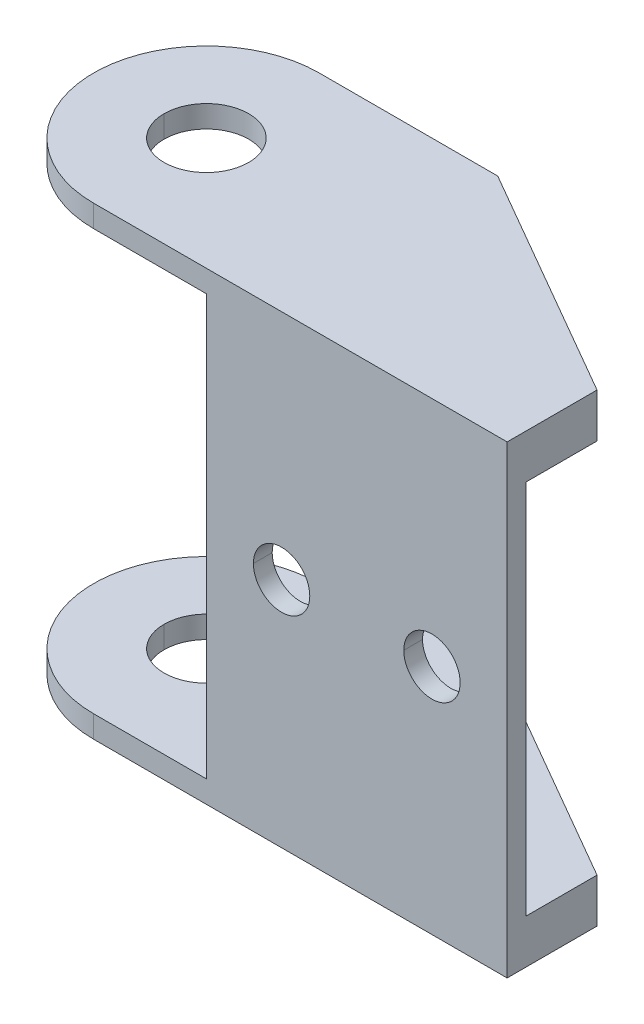
ISO-10303-21;
HEADER;
FILE_DESCRIPTION(('STEP AP214'),'2;1');
FILE_NAME('part.step','',(''),(''),'','','');
FILE_SCHEMA(('AUTOMOTIVE_DESIGN { 1 0 10303 214 1 1 1 1 }'));
ENDSEC;
DATA;
#1=APPLICATION_CONTEXT('core data for automotive mechanical design processes');
#2=APPLICATION_PROTOCOL_DEFINITION('international standard','automotive_design',2000,#1);
#3=PRODUCT_CONTEXT('',#1,'mechanical');
#4=PRODUCT('Part','Part','',(#3));
#5=PRODUCT_RELATED_PRODUCT_CATEGORY('part','',(#4));
#6=PRODUCT_DEFINITION_FORMATION('','',#4);
#7=PRODUCT_DEFINITION_CONTEXT('part definition',#1,'design');
#8=PRODUCT_DEFINITION('design','',#6,#7);
#9=PRODUCT_DEFINITION_SHAPE('','',#8);
#10=(LENGTH_UNIT() NAMED_UNIT(*) SI_UNIT(.MILLI.,.METRE.));
#11=(NAMED_UNIT(*) PLANE_ANGLE_UNIT() SI_UNIT($,.RADIAN.));
#12=(NAMED_UNIT(*) SI_UNIT($,.STERADIAN.) SOLID_ANGLE_UNIT());
#13=UNCERTAINTY_MEASURE_WITH_UNIT(LENGTH_MEASURE(1.E-05),#10,'distance_accuracy_value','');
#14=(GEOMETRIC_REPRESENTATION_CONTEXT(3) GLOBAL_UNCERTAINTY_ASSIGNED_CONTEXT((#13)) GLOBAL_UNIT_ASSIGNED_CONTEXT((#10,
#11,#12)) REPRESENTATION_CONTEXT('',''));
#15=CARTESIAN_POINT('',(0.,0.,0.));
#16=DIRECTION('',(0.,0.,1.));
#17=DIRECTION('',(1.,0.,0.));
#18=AXIS2_PLACEMENT_3D('',#15,#16,#17);
#19=CARTESIAN_POINT('',(0.,-1.175,76.));
#20=DIRECTION('',(0.,1.,0.));
#21=DIRECTION('',(1.,0.,0.));
#22=AXIS2_PLACEMENT_3D('',#19,#20,#21);
#23=PLANE('',#22);
#24=CARTESIAN_POINT('',(0.,-1.175,76.));
#25=DIRECTION('',(0.,-1.,0.));
#26=DIRECTION('',(1.,0.,0.));
#27=AXIS2_PLACEMENT_3D('',#24,#25,#26);
#28=CIRCLE('',#27,2.25);
#29=CARTESIAN_POINT('',(-2.25,-1.175,76.));
#30=VERTEX_POINT('',#29);
#31=CARTESIAN_POINT('',(2.25,-1.175,76.));
#32=VERTEX_POINT('',#31);
#33=EDGE_CURVE('E257',#30,#32,#28,.T.);
#34=ORIENTED_EDGE('',*,*,#33,.T.);
#35=CARTESIAN_POINT('',(0.,-1.175,76.));
#36=DIRECTION('',(0.,-1.,0.));
#37=DIRECTION('',(1.,0.,0.));
#38=AXIS2_PLACEMENT_3D('',#35,#36,#37);
#39=CIRCLE('',#38,2.25);
#40=EDGE_CURVE('E411',#32,#30,#39,.T.);
#41=ORIENTED_EDGE('',*,*,#40,.T.);
#42=EDGE_LOOP('',(#34,#41));
#43=FACE_BOUND('',#42,.T.);
#44=CARTESIAN_POINT('',(0.,-1.175,76.));
#45=DIRECTION('',(0.,-1.,0.));
#46=DIRECTION('',(0.,0.,-1.));
#47=AXIS2_PLACEMENT_3D('',#44,#45,#46);
#48=CIRCLE('',#47,6.);
#49=CARTESIAN_POINT('',(0.,-1.175,82.));
#50=VERTEX_POINT('',#49);
#51=CARTESIAN_POINT('',(0.,-1.175,70.));
#52=VERTEX_POINT('',#51);
#53=EDGE_CURVE('E293',#50,#52,#48,.T.);
#54=ORIENTED_EDGE('',*,*,#53,.F.);
#55=DIRECTION('',(-1.,0.,0.));
#56=VECTOR('',#55,1.);
#57=CARTESIAN_POINT('',(5.5,-1.175,82.));
#58=LINE('',#57,#56);
#59=CARTESIAN_POINT('',(6.,-1.175,82.));
#60=VERTEX_POINT('',#59);
#61=EDGE_CURVE('E162',#60,#50,#58,.T.);
#62=ORIENTED_EDGE('',*,*,#61,.F.);
#63=DIRECTION('',(0.,0.,1.));
#64=VECTOR('',#63,1.);
#65=CARTESIAN_POINT('',(6.,-1.175,76.));
#66=LINE('',#65,#64);
#67=CARTESIAN_POINT('',(6.,-1.175,70.));
#68=VERTEX_POINT('',#67);
#69=EDGE_CURVE('E283',#68,#60,#66,.T.);
#70=ORIENTED_EDGE('',*,*,#69,.F.);
#71=DIRECTION('',(1.,0.,0.));
#72=VECTOR('',#71,1.);
#73=CARTESIAN_POINT('',(2.375,-1.175,70.));
#74=LINE('',#73,#72);
#75=EDGE_CURVE('E173',#52,#68,#74,.T.);
#76=ORIENTED_EDGE('',*,*,#75,.F.);
#77=EDGE_LOOP('',(#54,#62,#70,#76));
#78=FACE_BOUND('',#77,.T.);
#79=ADVANCED_FACE('F16',(#43,#78),#23,.T.);
#80=CARTESIAN_POINT('',(11.,0.,76.));
#81=DIRECTION('',(0.,1.,0.));
#82=DIRECTION('',(1.,0.,0.));
#83=AXIS2_PLACEMENT_3D('',#80,#81,#82);
#84=PLANE('',#83);
#85=DIRECTION('',(1.,0.,0.));
#86=VECTOR('',#85,1.);
#87=CARTESIAN_POINT('',(12.5,0.,81.));
#88=LINE('',#87,#86);
#89=CARTESIAN_POINT('',(6.,0.,81.));
#90=VERTEX_POINT('',#89);
#91=CARTESIAN_POINT('',(22.,0.,81.));
#92=VERTEX_POINT('',#91);
#93=EDGE_CURVE('E351',#90,#92,#88,.T.);
#94=ORIENTED_EDGE('',*,*,#93,.T.);
#95=DIRECTION('',(0.,0.,1.));
#96=VECTOR('',#95,1.);
#97=CARTESIAN_POINT('',(22.,0.,77.804219591225));
#98=LINE('',#97,#96);
#99=CARTESIAN_POINT('',(22.,0.,77.2168783649));
#100=VERTEX_POINT('',#99);
#101=EDGE_CURVE('E308',#100,#92,#98,.T.);
#102=ORIENTED_EDGE('',*,*,#101,.F.);
#103=DIRECTION('',(0.866025403783548,0.,0.500000000001542));
#104=VECTOR('',#103,1.);
#105=CARTESIAN_POINT('',(14.4865381056782,0.,72.8789791176495));
#106=LINE('',#105,#104);
#107=CARTESIAN_POINT('',(9.5,0.,70.));
#108=VERTEX_POINT('',#107);
#109=EDGE_CURVE('E11',#108,#100,#106,.T.);
#110=ORIENTED_EDGE('',*,*,#109,.F.);
#111=DIRECTION('',(1.,0.,0.));
#112=VECTOR('',#111,1.);
#113=CARTESIAN_POINT('',(7.875,0.,70.));
#114=LINE('',#113,#112);
#115=CARTESIAN_POINT('',(6.,0.,70.));
#116=VERTEX_POINT('',#115);
#117=EDGE_CURVE('E324',#116,#108,#114,.T.);
#118=ORIENTED_EDGE('',*,*,#117,.F.);
#119=DIRECTION('',(0.,0.,-1.));
#120=VECTOR('',#119,1.);
#121=CARTESIAN_POINT('',(6.,0.,76.));
#122=LINE('',#121,#120);
#123=EDGE_CURVE('E285',#90,#116,#122,.T.);
#124=ORIENTED_EDGE('',*,*,#123,.F.);
#125=EDGE_LOOP('',(#94,#102,#110,#118,#124));
#126=FACE_BOUND('',#125,.T.);
#127=ADVANCED_FACE('F449',(#126),#84,.T.);
#128=CARTESIAN_POINT('',(15.75,22.35,73.60843918245));
#129=DIRECTION('',(0.500000000001542,0.,-0.866025403783548));
#130=DIRECTION('',(0.,-1.,0.));
#131=AXIS2_PLACEMENT_3D('',#128,#129,#130);
#132=PLANE('',#131);
#133=ORIENTED_EDGE('',*,*,#109,.T.);
#134=DIRECTION('',(0.,-1.,0.));
#135=VECTOR('',#134,1.);
#136=CARTESIAN_POINT('',(22.,22.35,77.2168783649));
#137=LINE('',#136,#135);
#138=CARTESIAN_POINT('',(22.,-2.35,77.2168783649));
#139=VERTEX_POINT('',#138);
#140=EDGE_CURVE('E20',#100,#139,#137,.T.);
#141=ORIENTED_EDGE('',*,*,#140,.T.);
#142=DIRECTION('',(-0.866025403783548,0.,-0.500000000001542));
#143=VECTOR('',#142,1.);
#144=CARTESIAN_POINT('',(9.5,-2.35,70.));
#145=LINE('',#144,#143);
#146=CARTESIAN_POINT('',(9.5,-2.35,70.));
#147=VERTEX_POINT('',#146);
#148=EDGE_CURVE('E420',#139,#147,#145,.T.);
#149=ORIENTED_EDGE('',*,*,#148,.T.);
#150=DIRECTION('',(0.,-1.,0.));
#151=VECTOR('',#150,1.);
#152=CARTESIAN_POINT('',(9.5,22.35,70.));
#153=LINE('',#152,#151);
#154=EDGE_CURVE('E309',#108,#147,#153,.T.);
#155=ORIENTED_EDGE('',*,*,#154,.F.);
#156=EDGE_LOOP('',(#133,#141,#149,#155));
#157=FACE_BOUND('',#156,.T.);
#158=ADVANCED_FACE('F519',(#157),#132,.T.);
#159=CARTESIAN_POINT('',(22.,22.35,79.60843918245));
#160=DIRECTION('',(1.,0.,0.));
#161=DIRECTION('',(0.,1.,0.));
#162=AXIS2_PLACEMENT_3D('',#159,#160,#161);
#163=PLANE('',#162);
#164=ORIENTED_EDGE('',*,*,#101,.T.);
#165=DIRECTION('',(0.,-1.,0.));
#166=VECTOR('',#165,1.);
#167=CARTESIAN_POINT('',(22.,21.175,81.));
#168=LINE('',#167,#166);
#169=CARTESIAN_POINT('',(22.,20.,81.));
#170=VERTEX_POINT('',#169);
#171=EDGE_CURVE('E374',#170,#92,#168,.T.);
#172=ORIENTED_EDGE('',*,*,#171,.F.);
#173=DIRECTION('',(0.,0.,-1.));
#174=VECTOR('',#173,1.);
#175=CARTESIAN_POINT('',(22.,20.,77.804219591225));
#176=LINE('',#175,#174);
#177=CARTESIAN_POINT('',(22.,20.,77.2168783649));
#178=VERTEX_POINT('',#177);
#179=EDGE_CURVE('E300',#170,#178,#176,.T.);
#180=ORIENTED_EDGE('',*,*,#179,.T.);
#181=DIRECTION('',(0.,-1.,0.));
#182=VECTOR('',#181,1.);
#183=CARTESIAN_POINT('',(22.,22.35,77.2168783649));
#184=LINE('',#183,#182);
#185=CARTESIAN_POINT('',(22.,22.35,77.2168783649));
#186=VERTEX_POINT('',#185);
#187=EDGE_CURVE('E334',#186,#178,#184,.T.);
#188=ORIENTED_EDGE('',*,*,#187,.F.);
#189=DIRECTION('',(0.,0.,1.));
#190=VECTOR('',#189,1.);
#191=CARTESIAN_POINT('',(22.,22.35,77.2168783649));
#192=LINE('',#191,#190);
#193=CARTESIAN_POINT('',(22.,22.35,82.));
#194=VERTEX_POINT('',#193);
#195=EDGE_CURVE('E252',#186,#194,#192,.T.);
#196=ORIENTED_EDGE('',*,*,#195,.T.);
#197=DIRECTION('',(0.,-1.,0.));
#198=VECTOR('',#197,1.);
#199=CARTESIAN_POINT('',(22.,22.35,82.));
#200=LINE('',#199,#198);
#201=CARTESIAN_POINT('',(22.,-2.35,82.));
#202=VERTEX_POINT('',#201);
#203=EDGE_CURVE('E155',#194,#202,#200,.T.);
#204=ORIENTED_EDGE('',*,*,#203,.T.);
#205=DIRECTION('',(0.,0.,-1.));
#206=VECTOR('',#205,1.);
#207=CARTESIAN_POINT('',(22.,-2.35,77.2168783649));
#208=LINE('',#207,#206);
#209=EDGE_CURVE('E248',#202,#139,#208,.T.);
#210=ORIENTED_EDGE('',*,*,#209,.T.);
#211=ORIENTED_EDGE('',*,*,#140,.F.);
#212=EDGE_LOOP('',(#164,#172,#180,#188,#196,#204,#210,#211));
#213=FACE_BOUND('',#212,.T.);
#214=ADVANCED_FACE('F394',(#213),#163,.T.);
#215=CARTESIAN_POINT('',(4.75,22.35,70.));
#216=DIRECTION('',(0.,0.,-1.));
#217=DIRECTION('',(0.,-1.,0.));
#218=AXIS2_PLACEMENT_3D('',#215,#216,#217);
#219=PLANE('',#218);
#220=ORIENTED_EDGE('',*,*,#117,.T.);
#221=ORIENTED_EDGE('',*,*,#154,.T.);
#222=DIRECTION('',(-1.,0.,0.));
#223=VECTOR('',#222,1.);
#224=CARTESIAN_POINT('',(0.,-2.35,70.));
#225=LINE('',#224,#223);
#226=CARTESIAN_POINT('',(0.,-2.35,70.));
#227=VERTEX_POINT('',#226);
#228=EDGE_CURVE('E424',#147,#227,#225,.T.);
#229=ORIENTED_EDGE('',*,*,#228,.T.);
#230=DIRECTION('',(0.,-1.,0.));
#231=VECTOR('',#230,1.);
#232=CARTESIAN_POINT('',(0.,22.35,70.));
#233=LINE('',#232,#231);
#234=EDGE_CURVE('E284',#52,#227,#233,.T.);
#235=ORIENTED_EDGE('',*,*,#234,.F.);
#236=ORIENTED_EDGE('',*,*,#75,.T.);
#237=DIRECTION('',(0.,1.,0.));
#238=VECTOR('',#237,1.);
#239=CARTESIAN_POINT('',(6.,16.175,70.));
#240=LINE('',#239,#238);
#241=EDGE_CURVE('E289',#68,#116,#240,.T.);
#242=ORIENTED_EDGE('',*,*,#241,.T.);
#243=EDGE_LOOP('',(#220,#221,#229,#235,#236,#242));
#244=FACE_BOUND('',#243,.T.);
#245=ADVANCED_FACE('F518',(#244),#219,.T.);
#246=CARTESIAN_POINT('',(11.,22.35,82.));
#247=DIRECTION('',(0.,0.,1.));
#248=DIRECTION('',(1.,0.,0.));
#249=AXIS2_PLACEMENT_3D('',#246,#247,#248);
#250=PLANE('',#249);
#251=CARTESIAN_POINT('',(18.,10.,82.));
#252=DIRECTION('',(0.,0.,-1.));
#253=DIRECTION('',(1.,0.,0.));
#254=AXIS2_PLACEMENT_3D('',#251,#252,#253);
#255=CIRCLE('',#254,1.5);
#256=CARTESIAN_POINT('',(19.5,10.,82.));
#257=VERTEX_POINT('',#256);
#258=CARTESIAN_POINT('',(16.5,10.,82.));
#259=VERTEX_POINT('',#258);
#260=EDGE_CURVE('E229',#257,#259,#255,.T.);
#261=ORIENTED_EDGE('',*,*,#260,.T.);
#262=CARTESIAN_POINT('',(18.,10.,82.));
#263=DIRECTION('',(0.,0.,-1.));
#264=DIRECTION('',(1.,0.,0.));
#265=AXIS2_PLACEMENT_3D('',#262,#263,#264);
#266=CIRCLE('',#265,1.5);
#267=EDGE_CURVE('E216',#259,#257,#266,.T.);
#268=ORIENTED_EDGE('',*,*,#267,.T.);
#269=EDGE_LOOP('',(#261,#268));
#270=FACE_BOUND('',#269,.T.);
#271=CARTESIAN_POINT('',(10.,10.,82.));
#272=DIRECTION('',(0.,0.,-1.));
#273=DIRECTION('',(1.,0.,0.));
#274=AXIS2_PLACEMENT_3D('',#271,#272,#273);
#275=CIRCLE('',#274,1.5);
#276=CARTESIAN_POINT('',(11.5,10.,82.));
#277=VERTEX_POINT('',#276);
#278=CARTESIAN_POINT('',(8.5,10.,82.));
#279=VERTEX_POINT('',#278);
#280=EDGE_CURVE('E274',#277,#279,#275,.T.);
#281=ORIENTED_EDGE('',*,*,#280,.T.);
#282=CARTESIAN_POINT('',(10.,10.,82.));
#283=DIRECTION('',(0.,0.,-1.));
#284=DIRECTION('',(1.,0.,0.));
#285=AXIS2_PLACEMENT_3D('',#282,#283,#284);
#286=CIRCLE('',#285,1.5);
#287=EDGE_CURVE('E278',#279,#277,#286,.T.);
#288=ORIENTED_EDGE('',*,*,#287,.T.);
#289=EDGE_LOOP('',(#281,#288));
#290=FACE_BOUND('',#289,.T.);
#291=ORIENTED_EDGE('',*,*,#203,.F.);
#292=DIRECTION('',(-1.,0.,0.));
#293=VECTOR('',#292,1.);
#294=CARTESIAN_POINT('',(22.,22.35,82.));
#295=LINE('',#294,#293);
#296=CARTESIAN_POINT('',(0.,22.35,82.));
#297=VERTEX_POINT('',#296);
#298=EDGE_CURVE('E250',#194,#297,#295,.T.);
#299=ORIENTED_EDGE('',*,*,#298,.T.);
#300=DIRECTION('',(0.,-1.,0.));
#301=VECTOR('',#300,1.);
#302=CARTESIAN_POINT('',(0.,22.35,82.));
#303=LINE('',#302,#301);
#304=CARTESIAN_POINT('',(0.,21.175,82.));
#305=VERTEX_POINT('',#304);
#306=EDGE_CURVE('E313',#297,#305,#303,.T.);
#307=ORIENTED_EDGE('',*,*,#306,.T.);
#308=DIRECTION('',(1.,0.,0.));
#309=VECTOR('',#308,1.);
#310=CARTESIAN_POINT('',(5.5,21.175,82.));
#311=LINE('',#310,#309);
#312=CARTESIAN_POINT('',(6.,21.175,82.));
#313=VERTEX_POINT('',#312);
#314=EDGE_CURVE('E371',#305,#313,#311,.T.);
#315=ORIENTED_EDGE('',*,*,#314,.T.);
#316=DIRECTION('',(0.,-1.,0.));
#317=VECTOR('',#316,1.);
#318=CARTESIAN_POINT('',(6.,16.175,82.));
#319=LINE('',#318,#317);
#320=EDGE_CURVE('E290',#313,#60,#319,.T.);
#321=ORIENTED_EDGE('',*,*,#320,.T.);
#322=ORIENTED_EDGE('',*,*,#61,.T.);
#323=DIRECTION('',(0.,-1.,0.));
#324=VECTOR('',#323,1.);
#325=CARTESIAN_POINT('',(0.,22.35,82.));
#326=LINE('',#325,#324);
#327=CARTESIAN_POINT('',(0.,-2.35,82.));
#328=VERTEX_POINT('',#327);
#329=EDGE_CURVE('E280',#50,#328,#326,.T.);
#330=ORIENTED_EDGE('',*,*,#329,.T.);
#331=DIRECTION('',(1.,0.,0.));
#332=VECTOR('',#331,1.);
#333=CARTESIAN_POINT('',(22.,-2.35,82.));
#334=LINE('',#333,#332);
#335=EDGE_CURVE('E419',#328,#202,#334,.T.);
#336=ORIENTED_EDGE('',*,*,#335,.T.);
#337=EDGE_LOOP('',(#291,#299,#307,#315,#321,#322,#330,#336));
#338=FACE_BOUND('',#337,.T.);
#339=ADVANCED_FACE('F230',(#270,#290,#338),#250,.T.);
#340=CARTESIAN_POINT('',(6.,10.,76.));
#341=DIRECTION('',(-1.,0.,0.));
#342=DIRECTION('',(0.,0.,1.));
#343=AXIS2_PLACEMENT_3D('',#340,#341,#342);
#344=PLANE('',#343);
#345=ORIENTED_EDGE('',*,*,#69,.T.);
#346=ORIENTED_EDGE('',*,*,#320,.F.);
#347=DIRECTION('',(0.,0.,-1.));
#348=VECTOR('',#347,1.);
#349=CARTESIAN_POINT('',(6.,21.175,76.));
#350=LINE('',#349,#348);
#351=CARTESIAN_POINT('',(6.,21.175,70.));
#352=VERTEX_POINT('',#351);
#353=EDGE_CURVE('E356',#313,#352,#350,.T.);
#354=ORIENTED_EDGE('',*,*,#353,.T.);
#355=DIRECTION('',(0.,1.,0.));
#356=VECTOR('',#355,1.);
#357=CARTESIAN_POINT('',(6.,16.175,70.));
#358=LINE('',#357,#356);
#359=CARTESIAN_POINT('',(6.,20.,70.));
#360=VERTEX_POINT('',#359);
#361=EDGE_CURVE('E326',#360,#352,#358,.T.);
#362=ORIENTED_EDGE('',*,*,#361,.F.);
#363=DIRECTION('',(0.,0.,1.));
#364=VECTOR('',#363,1.);
#365=CARTESIAN_POINT('',(6.,20.,76.));
#366=LINE('',#365,#364);
#367=CARTESIAN_POINT('',(6.,20.,81.));
#368=VERTEX_POINT('',#367);
#369=EDGE_CURVE('E361',#360,#368,#366,.T.);
#370=ORIENTED_EDGE('',*,*,#369,.T.);
#371=DIRECTION('',(0.,-1.,0.));
#372=VECTOR('',#371,1.);
#373=CARTESIAN_POINT('',(6.,21.175,81.));
#374=LINE('',#373,#372);
#375=EDGE_CURVE('E355',#368,#90,#374,.T.);
#376=ORIENTED_EDGE('',*,*,#375,.T.);
#377=ORIENTED_EDGE('',*,*,#123,.T.);
#378=ORIENTED_EDGE('',*,*,#241,.F.);
#379=EDGE_LOOP('',(#345,#346,#354,#362,#370,#376,#377,#378));
#380=FACE_BOUND('',#379,.T.);
#381=ADVANCED_FACE('F454',(#380),#344,.T.);
#382=CARTESIAN_POINT('',(0.,22.35,76.));
#383=DIRECTION('',(0.,-1.,0.));
#384=DIRECTION('',(0.,0.,-1.));
#385=AXIS2_PLACEMENT_3D('',#382,#383,#384);
#386=CYLINDRICAL_SURFACE('',#385,6.);
#387=ORIENTED_EDGE('',*,*,#53,.T.);
#388=ORIENTED_EDGE('',*,*,#234,.T.);
#389=CARTESIAN_POINT('',(0.,-2.35,76.));
#390=DIRECTION('',(0.,1.,0.));
#391=DIRECTION('',(0.,0.,-1.));
#392=AXIS2_PLACEMENT_3D('',#389,#390,#391);
#393=CIRCLE('',#392,6.);
#394=EDGE_CURVE('E350',#227,#328,#393,.T.);
#395=ORIENTED_EDGE('',*,*,#394,.T.);
#396=ORIENTED_EDGE('',*,*,#329,.F.);
#397=EDGE_LOOP('',(#387,#388,#395,#396));
#398=FACE_BOUND('',#397,.T.);
#399=ADVANCED_FACE('F594',(#398),#386,.T.);
#400=CARTESIAN_POINT('',(7.97467966244913,-2.35,76.8300036802214));
#401=DIRECTION('',(0.,1.,0.));
#402=DIRECTION('',(1.,0.,0.));
#403=AXIS2_PLACEMENT_3D('',#400,#401,#402);
#404=PLANE('',#403);
#405=CARTESIAN_POINT('',(0.,-2.35,76.));
#406=DIRECTION('',(0.,1.,0.));
#407=DIRECTION('',(1.,0.,0.));
#408=AXIS2_PLACEMENT_3D('',#405,#406,#407);
#409=CIRCLE('',#408,2.25);
#410=CARTESIAN_POINT('',(2.25,-2.35,76.));
#411=VERTEX_POINT('',#410);
#412=CARTESIAN_POINT('',(-2.25,-2.35,76.));
#413=VERTEX_POINT('',#412);
#414=EDGE_CURVE('E260',#411,#413,#409,.T.);
#415=ORIENTED_EDGE('',*,*,#414,.T.);
#416=CARTESIAN_POINT('',(0.,-2.35,76.));
#417=DIRECTION('',(0.,1.,0.));
#418=DIRECTION('',(1.,0.,0.));
#419=AXIS2_PLACEMENT_3D('',#416,#417,#418);
#420=CIRCLE('',#419,2.25);
#421=EDGE_CURVE('E270',#413,#411,#420,.T.);
#422=ORIENTED_EDGE('',*,*,#421,.T.);
#423=EDGE_LOOP('',(#415,#422));
#424=FACE_BOUND('',#423,.T.);
#425=ORIENTED_EDGE('',*,*,#394,.F.);
#426=ORIENTED_EDGE('',*,*,#228,.F.);
#427=ORIENTED_EDGE('',*,*,#148,.F.);
#428=ORIENTED_EDGE('',*,*,#209,.F.);
#429=ORIENTED_EDGE('',*,*,#335,.F.);
#430=EDGE_LOOP('',(#425,#426,#427,#428,#429));
#431=FACE_BOUND('',#430,.T.);
#432=ADVANCED_FACE('F543',(#424,#431),#404,.F.);
#433=CARTESIAN_POINT('',(0.,10.,76.));
#434=DIRECTION('',(0.,-1.,0.));
#435=DIRECTION('',(1.,0.,0.));
#436=AXIS2_PLACEMENT_3D('',#433,#434,#435);
#437=CYLINDRICAL_SURFACE('',#436,2.25);
#438=DIRECTION('',(0.,1.,0.));
#439=VECTOR('',#438,1.);
#440=CARTESIAN_POINT('',(2.25,-1.7625,76.));
#441=LINE('',#440,#439);
#442=EDGE_CURVE('E267',#411,#32,#441,.T.);
#443=ORIENTED_EDGE('',*,*,#442,.T.);
#444=ORIENTED_EDGE('',*,*,#33,.F.);
#445=DIRECTION('',(0.,-1.,0.));
#446=VECTOR('',#445,1.);
#447=CARTESIAN_POINT('',(-2.25,-1.7625,76.));
#448=LINE('',#447,#446);
#449=EDGE_CURVE('E433',#30,#413,#448,.T.);
#450=ORIENTED_EDGE('',*,*,#449,.T.);
#451=ORIENTED_EDGE('',*,*,#414,.F.);
#452=EDGE_LOOP('',(#443,#444,#450,#451));
#453=FACE_BOUND('',#452,.T.);
#454=ADVANCED_FACE('F538',(#453),#437,.F.);
#455=CARTESIAN_POINT('',(0.,10.,76.));
#456=DIRECTION('',(0.,-1.,0.));
#457=DIRECTION('',(1.,0.,0.));
#458=AXIS2_PLACEMENT_3D('',#455,#456,#457);
#459=CYLINDRICAL_SURFACE('',#458,2.25);
#460=DIRECTION('',(0.,1.,0.));
#461=VECTOR('',#460,1.);
#462=CARTESIAN_POINT('',(2.25,21.7625,76.));
#463=LINE('',#462,#461);
#464=CARTESIAN_POINT('',(2.25,21.175,76.));
#465=VERTEX_POINT('',#464);
#466=CARTESIAN_POINT('',(2.25,22.35,76.));
#467=VERTEX_POINT('',#466);
#468=EDGE_CURVE('E322',#465,#467,#463,.T.);
#469=ORIENTED_EDGE('',*,*,#468,.T.);
#470=CARTESIAN_POINT('',(0.,22.35,76.));
#471=DIRECTION('',(0.,-1.,0.));
#472=DIRECTION('',(1.,0.,0.));
#473=AXIS2_PLACEMENT_3D('',#470,#471,#472);
#474=CIRCLE('',#473,2.25);
#475=CARTESIAN_POINT('',(-2.25,22.35,76.));
#476=VERTEX_POINT('',#475);
#477=EDGE_CURVE('E261',#476,#467,#474,.T.);
#478=ORIENTED_EDGE('',*,*,#477,.F.);
#479=DIRECTION('',(0.,-1.,0.));
#480=VECTOR('',#479,1.);
#481=CARTESIAN_POINT('',(-2.25,21.7625,76.));
#482=LINE('',#481,#480);
#483=CARTESIAN_POINT('',(-2.25,21.175,76.));
#484=VERTEX_POINT('',#483);
#485=EDGE_CURVE('E265',#476,#484,#482,.T.);
#486=ORIENTED_EDGE('',*,*,#485,.T.);
#487=CARTESIAN_POINT('',(0.,21.175,76.));
#488=DIRECTION('',(0.,1.,0.));
#489=DIRECTION('',(1.,0.,0.));
#490=AXIS2_PLACEMENT_3D('',#487,#488,#489);
#491=CIRCLE('',#490,2.25);
#492=EDGE_CURVE('E359',#465,#484,#491,.T.);
#493=ORIENTED_EDGE('',*,*,#492,.F.);
#494=EDGE_LOOP('',(#469,#478,#486,#493));
#495=FACE_BOUND('',#494,.T.);
#496=ADVANCED_FACE('F542',(#495),#459,.F.);
#497=CARTESIAN_POINT('',(7.97467966244913,22.35,76.8300036802214));
#498=DIRECTION('',(0.,1.,0.));
#499=DIRECTION('',(1.,0.,0.));
#500=AXIS2_PLACEMENT_3D('',#497,#498,#499);
#501=PLANE('',#500);
#502=CARTESIAN_POINT('',(0.,22.35,76.));
#503=DIRECTION('',(0.,-1.,0.));
#504=DIRECTION('',(1.,0.,0.));
#505=AXIS2_PLACEMENT_3D('',#502,#503,#504);
#506=CIRCLE('',#505,2.25);
#507=EDGE_CURVE('E299',#467,#476,#506,.T.);
#508=ORIENTED_EDGE('',*,*,#507,.T.);
#509=ORIENTED_EDGE('',*,*,#477,.T.);
#510=EDGE_LOOP('',(#508,#509));
#511=FACE_BOUND('',#510,.T.);
#512=DIRECTION('',(1.,0.,0.));
#513=VECTOR('',#512,1.);
#514=CARTESIAN_POINT('',(0.,22.35,70.));
#515=LINE('',#514,#513);
#516=CARTESIAN_POINT('',(0.,22.35,70.));
#517=VERTEX_POINT('',#516);
#518=CARTESIAN_POINT('',(9.5,22.35,70.));
#519=VERTEX_POINT('',#518);
#520=EDGE_CURVE('E310',#517,#519,#515,.T.);
#521=ORIENTED_EDGE('',*,*,#520,.F.);
#522=CARTESIAN_POINT('',(0.,22.35,76.));
#523=DIRECTION('',(0.,1.,0.));
#524=DIRECTION('',(0.,0.,-1.));
#525=AXIS2_PLACEMENT_3D('',#522,#523,#524);
#526=CIRCLE('',#525,6.);
#527=EDGE_CURVE('E253',#517,#297,#526,.T.);
#528=ORIENTED_EDGE('',*,*,#527,.T.);
#529=ORIENTED_EDGE('',*,*,#298,.F.);
#530=ORIENTED_EDGE('',*,*,#195,.F.);
#531=DIRECTION('',(0.866025403783548,0.,0.500000000001542));
#532=VECTOR('',#531,1.);
#533=CARTESIAN_POINT('',(9.5,22.35,70.));
#534=LINE('',#533,#532);
#535=EDGE_CURVE('E343',#519,#186,#534,.T.);
#536=ORIENTED_EDGE('',*,*,#535,.F.);
#537=EDGE_LOOP('',(#521,#528,#529,#530,#536));
#538=FACE_BOUND('',#537,.T.);
#539=ADVANCED_FACE('F391',(#511,#538),#501,.T.);
#540=CARTESIAN_POINT('',(0.,22.35,76.));
#541=DIRECTION('',(0.,-1.,0.));
#542=DIRECTION('',(0.,0.,-1.));
#543=AXIS2_PLACEMENT_3D('',#540,#541,#542);
#544=CYLINDRICAL_SURFACE('',#543,6.);
#545=CARTESIAN_POINT('',(0.,21.175,76.));
#546=DIRECTION('',(0.,1.,0.));
#547=DIRECTION('',(0.,0.,-1.));
#548=AXIS2_PLACEMENT_3D('',#545,#546,#547);
#549=CIRCLE('',#548,6.);
#550=CARTESIAN_POINT('',(0.,21.175,70.));
#551=VERTEX_POINT('',#550);
#552=EDGE_CURVE('E368',#551,#305,#549,.T.);
#553=ORIENTED_EDGE('',*,*,#552,.T.);
#554=ORIENTED_EDGE('',*,*,#306,.F.);
#555=ORIENTED_EDGE('',*,*,#527,.F.);
#556=DIRECTION('',(0.,-1.,0.));
#557=VECTOR('',#556,1.);
#558=CARTESIAN_POINT('',(0.,22.35,70.));
#559=LINE('',#558,#557);
#560=EDGE_CURVE('E314',#517,#551,#559,.T.);
#561=ORIENTED_EDGE('',*,*,#560,.T.);
#562=EDGE_LOOP('',(#553,#554,#555,#561));
#563=FACE_BOUND('',#562,.T.);
#564=ADVANCED_FACE('F472',(#563),#544,.T.);
#565=CARTESIAN_POINT('',(4.75,22.35,70.));
#566=DIRECTION('',(0.,0.,-1.));
#567=DIRECTION('',(0.,-1.,0.));
#568=AXIS2_PLACEMENT_3D('',#565,#566,#567);
#569=PLANE('',#568);
#570=DIRECTION('',(-1.,0.,0.));
#571=VECTOR('',#570,1.);
#572=CARTESIAN_POINT('',(7.875,20.,70.));
#573=LINE('',#572,#571);
#574=CARTESIAN_POINT('',(9.5,20.,70.));
#575=VERTEX_POINT('',#574);
#576=EDGE_CURVE('E365',#575,#360,#573,.T.);
#577=ORIENTED_EDGE('',*,*,#576,.T.);
#578=ORIENTED_EDGE('',*,*,#361,.T.);
#579=DIRECTION('',(-1.,0.,0.));
#580=VECTOR('',#579,1.);
#581=CARTESIAN_POINT('',(2.375,21.175,70.));
#582=LINE('',#581,#580);
#583=EDGE_CURVE('E360',#352,#551,#582,.T.);
#584=ORIENTED_EDGE('',*,*,#583,.T.);
#585=ORIENTED_EDGE('',*,*,#560,.F.);
#586=ORIENTED_EDGE('',*,*,#520,.T.);
#587=DIRECTION('',(0.,-1.,0.));
#588=VECTOR('',#587,1.);
#589=CARTESIAN_POINT('',(9.5,22.35,70.));
#590=LINE('',#589,#588);
#591=EDGE_CURVE('E304',#519,#575,#590,.T.);
#592=ORIENTED_EDGE('',*,*,#591,.T.);
#593=EDGE_LOOP('',(#577,#578,#584,#585,#586,#592));
#594=FACE_BOUND('',#593,.T.);
#595=ADVANCED_FACE('F567',(#594),#569,.T.);
#596=CARTESIAN_POINT('',(15.75,22.35,73.60843918245));
#597=DIRECTION('',(0.500000000001542,0.,-0.866025403783548));
#598=DIRECTION('',(0.,-1.,0.));
#599=AXIS2_PLACEMENT_3D('',#596,#597,#598);
#600=PLANE('',#599);
#601=DIRECTION('',(-0.866025403783548,0.,-0.500000000001542));
#602=VECTOR('',#601,1.);
#603=CARTESIAN_POINT('',(14.4865381056782,20.,72.8789791176495));
#604=LINE('',#603,#602);
#605=EDGE_CURVE('E305',#178,#575,#604,.T.);
#606=ORIENTED_EDGE('',*,*,#605,.T.);
#607=ORIENTED_EDGE('',*,*,#591,.F.);
#608=ORIENTED_EDGE('',*,*,#535,.T.);
#609=ORIENTED_EDGE('',*,*,#187,.T.);
#610=EDGE_LOOP('',(#606,#607,#608,#609));
#611=FACE_BOUND('',#610,.T.);
#612=ADVANCED_FACE('F387',(#611),#600,.T.);
#613=CARTESIAN_POINT('',(11.,20.,76.));
#614=DIRECTION('',(0.,1.,0.));
#615=DIRECTION('',(1.,0.,0.));
#616=AXIS2_PLACEMENT_3D('',#613,#614,#615);
#617=PLANE('',#616);
#618=DIRECTION('',(-1.,0.,0.));
#619=VECTOR('',#618,1.);
#620=CARTESIAN_POINT('',(12.5,20.,81.));
#621=LINE('',#620,#619);
#622=EDGE_CURVE('E456',#170,#368,#621,.T.);
#623=ORIENTED_EDGE('',*,*,#622,.T.);
#624=ORIENTED_EDGE('',*,*,#369,.F.);
#625=ORIENTED_EDGE('',*,*,#576,.F.);
#626=ORIENTED_EDGE('',*,*,#605,.F.);
#627=ORIENTED_EDGE('',*,*,#179,.F.);
#628=EDGE_LOOP('',(#623,#624,#625,#626,#627));
#629=FACE_BOUND('',#628,.T.);
#630=ADVANCED_FACE('F402',(#629),#617,.F.);
#631=CARTESIAN_POINT('',(0.,21.175,76.));
#632=DIRECTION('',(0.,1.,0.));
#633=DIRECTION('',(1.,0.,0.));
#634=AXIS2_PLACEMENT_3D('',#631,#632,#633);
#635=PLANE('',#634);
#636=CARTESIAN_POINT('',(0.,21.175,76.));
#637=DIRECTION('',(0.,1.,0.));
#638=DIRECTION('',(1.,0.,0.));
#639=AXIS2_PLACEMENT_3D('',#636,#637,#638);
#640=CIRCLE('',#639,2.25);
#641=CARTESIAN_POINT('',(0.,21.175,78.25));
#642=VERTEX_POINT('',#641);
#643=EDGE_CURVE('E266',#642,#465,#640,.T.);
#644=ORIENTED_EDGE('',*,*,#643,.T.);
#645=ORIENTED_EDGE('',*,*,#492,.T.);
#646=CARTESIAN_POINT('',(0.,21.175,76.));
#647=DIRECTION('',(0.,1.,0.));
#648=DIRECTION('',(1.,0.,0.));
#649=AXIS2_PLACEMENT_3D('',#646,#647,#648);
#650=CIRCLE('',#649,2.25);
#651=EDGE_CURVE('E262',#484,#642,#650,.T.);
#652=ORIENTED_EDGE('',*,*,#651,.T.);
#653=EDGE_LOOP('',(#644,#645,#652));
#654=FACE_BOUND('',#653,.T.);
#655=ORIENTED_EDGE('',*,*,#314,.F.);
#656=ORIENTED_EDGE('',*,*,#552,.F.);
#657=ORIENTED_EDGE('',*,*,#583,.F.);
#658=ORIENTED_EDGE('',*,*,#353,.F.);
#659=EDGE_LOOP('',(#655,#656,#657,#658));
#660=FACE_BOUND('',#659,.T.);
#661=ADVANCED_FACE('F441',(#654,#660),#635,.F.);
#662=CARTESIAN_POINT('',(14.,21.175,81.));
#663=DIRECTION('',(0.,0.,-1.));
#664=DIRECTION('',(0.,-1.,0.));
#665=AXIS2_PLACEMENT_3D('',#662,#663,#664);
#666=PLANE('',#665);
#667=CARTESIAN_POINT('',(18.,10.,81.));
#668=DIRECTION('',(0.,0.,1.));
#669=DIRECTION('',(1.,0.,0.));
#670=AXIS2_PLACEMENT_3D('',#667,#668,#669);
#671=CIRCLE('',#670,1.5);
#672=CARTESIAN_POINT('',(19.5,10.,81.));
#673=VERTEX_POINT('',#672);
#674=CARTESIAN_POINT('',(16.5,10.,81.));
#675=VERTEX_POINT('',#674);
#676=EDGE_CURVE('E227',#673,#675,#671,.T.);
#677=ORIENTED_EDGE('',*,*,#676,.T.);
#678=CARTESIAN_POINT('',(18.,10.,81.));
#679=DIRECTION('',(0.,0.,1.));
#680=DIRECTION('',(1.,0.,0.));
#681=AXIS2_PLACEMENT_3D('',#678,#679,#680);
#682=CIRCLE('',#681,1.5);
#683=EDGE_CURVE('E238',#675,#673,#682,.T.);
#684=ORIENTED_EDGE('',*,*,#683,.T.);
#685=EDGE_LOOP('',(#677,#684));
#686=FACE_BOUND('',#685,.T.);
#687=CARTESIAN_POINT('',(10.,10.,81.));
#688=DIRECTION('',(0.,0.,1.));
#689=DIRECTION('',(1.,0.,0.));
#690=AXIS2_PLACEMENT_3D('',#687,#688,#689);
#691=CIRCLE('',#690,1.5);
#692=CARTESIAN_POINT('',(11.5,10.,81.));
#693=VERTEX_POINT('',#692);
#694=CARTESIAN_POINT('',(8.5,10.,81.));
#695=VERTEX_POINT('',#694);
#696=EDGE_CURVE('E209',#693,#695,#691,.T.);
#697=ORIENTED_EDGE('',*,*,#696,.T.);
#698=CARTESIAN_POINT('',(10.,10.,81.));
#699=DIRECTION('',(0.,0.,1.));
#700=DIRECTION('',(1.,0.,0.));
#701=AXIS2_PLACEMENT_3D('',#698,#699,#700);
#702=CIRCLE('',#701,1.5);
#703=EDGE_CURVE('E256',#695,#693,#702,.T.);
#704=ORIENTED_EDGE('',*,*,#703,.T.);
#705=EDGE_LOOP('',(#697,#704));
#706=FACE_BOUND('',#705,.T.);
#707=ORIENTED_EDGE('',*,*,#93,.F.);
#708=ORIENTED_EDGE('',*,*,#375,.F.);
#709=ORIENTED_EDGE('',*,*,#622,.F.);
#710=ORIENTED_EDGE('',*,*,#171,.T.);
#711=EDGE_LOOP('',(#707,#708,#709,#710));
#712=FACE_BOUND('',#711,.T.);
#713=ADVANCED_FACE('F438',(#686,#706,#712),#666,.T.);
#714=CARTESIAN_POINT('',(18.,10.,81.5));
#715=DIRECTION('',(0.,0.,-1.));
#716=DIRECTION('',(1.,0.,0.));
#717=AXIS2_PLACEMENT_3D('',#714,#715,#716);
#718=CYLINDRICAL_SURFACE('',#717,1.5);
#719=DIRECTION('',(0.,0.,1.));
#720=VECTOR('',#719,1.);
#721=CARTESIAN_POINT('',(19.5,10.,81.5));
#722=LINE('',#721,#720);
#723=EDGE_CURVE('E223',#673,#257,#722,.T.);
#724=ORIENTED_EDGE('',*,*,#723,.T.);
#725=ORIENTED_EDGE('',*,*,#267,.F.);
#726=DIRECTION('',(0.,0.,-1.));
#727=VECTOR('',#726,1.);
#728=CARTESIAN_POINT('',(16.5,10.,81.5));
#729=LINE('',#728,#727);
#730=EDGE_CURVE('E220',#259,#675,#729,.T.);
#731=ORIENTED_EDGE('',*,*,#730,.T.);
#732=ORIENTED_EDGE('',*,*,#676,.F.);
#733=EDGE_LOOP('',(#724,#725,#731,#732));
#734=FACE_BOUND('',#733,.T.);
#735=ADVANCED_FACE('F218',(#734),#718,.F.);
#736=CARTESIAN_POINT('',(10.,10.,81.5));
#737=DIRECTION('',(0.,0.,-1.));
#738=DIRECTION('',(1.,0.,0.));
#739=AXIS2_PLACEMENT_3D('',#736,#737,#738);
#740=CYLINDRICAL_SURFACE('',#739,1.5);
#741=DIRECTION('',(0.,0.,1.));
#742=VECTOR('',#741,1.);
#743=CARTESIAN_POINT('',(11.5,10.,81.5));
#744=LINE('',#743,#742);
#745=EDGE_CURVE('E234',#693,#277,#744,.T.);
#746=ORIENTED_EDGE('',*,*,#745,.T.);
#747=ORIENTED_EDGE('',*,*,#287,.F.);
#748=DIRECTION('',(0.,0.,-1.));
#749=VECTOR('',#748,1.);
#750=CARTESIAN_POINT('',(8.5,10.,81.5));
#751=LINE('',#750,#749);
#752=EDGE_CURVE('E279',#279,#695,#751,.T.);
#753=ORIENTED_EDGE('',*,*,#752,.T.);
#754=ORIENTED_EDGE('',*,*,#696,.F.);
#755=EDGE_LOOP('',(#746,#747,#753,#754));
#756=FACE_BOUND('',#755,.T.);
#757=ADVANCED_FACE('F508',(#756),#740,.F.);
#758=CARTESIAN_POINT('',(10.,10.,81.5));
#759=DIRECTION('',(0.,0.,-1.));
#760=DIRECTION('',(1.,0.,0.));
#761=AXIS2_PLACEMENT_3D('',#758,#759,#760);
#762=CYLINDRICAL_SURFACE('',#761,1.5);
#763=ORIENTED_EDGE('',*,*,#745,.F.);
#764=ORIENTED_EDGE('',*,*,#703,.F.);
#765=ORIENTED_EDGE('',*,*,#752,.F.);
#766=ORIENTED_EDGE('',*,*,#280,.F.);
#767=EDGE_LOOP('',(#763,#764,#765,#766));
#768=FACE_BOUND('',#767,.T.);
#769=ADVANCED_FACE('F18',(#768),#762,.F.);
#770=CARTESIAN_POINT('',(18.,10.,81.5));
#771=DIRECTION('',(0.,0.,-1.));
#772=DIRECTION('',(1.,0.,0.));
#773=AXIS2_PLACEMENT_3D('',#770,#771,#772);
#774=CYLINDRICAL_SURFACE('',#773,1.5);
#775=ORIENTED_EDGE('',*,*,#723,.F.);
#776=ORIENTED_EDGE('',*,*,#683,.F.);
#777=ORIENTED_EDGE('',*,*,#730,.F.);
#778=ORIENTED_EDGE('',*,*,#260,.F.);
#779=EDGE_LOOP('',(#775,#776,#777,#778));
#780=FACE_BOUND('',#779,.T.);
#781=ADVANCED_FACE('F236',(#780),#774,.F.);
#782=CARTESIAN_POINT('',(0.,10.,76.));
#783=DIRECTION('',(0.,-1.,0.));
#784=DIRECTION('',(1.,0.,0.));
#785=AXIS2_PLACEMENT_3D('',#782,#783,#784);
#786=CYLINDRICAL_SURFACE('',#785,2.25);
#787=ORIENTED_EDGE('',*,*,#468,.F.);
#788=ORIENTED_EDGE('',*,*,#643,.F.);
#789=ORIENTED_EDGE('',*,*,#651,.F.);
#790=ORIENTED_EDGE('',*,*,#485,.F.);
#791=ORIENTED_EDGE('',*,*,#507,.F.);
#792=EDGE_LOOP('',(#787,#788,#789,#790,#791));
#793=FACE_BOUND('',#792,.T.);
#794=ADVANCED_FACE('F610',(#793),#786,.F.);
#795=CARTESIAN_POINT('',(0.,10.,76.));
#796=DIRECTION('',(0.,-1.,0.));
#797=DIRECTION('',(1.,0.,0.));
#798=AXIS2_PLACEMENT_3D('',#795,#796,#797);
#799=CYLINDRICAL_SURFACE('',#798,2.25);
#800=ORIENTED_EDGE('',*,*,#442,.F.);
#801=ORIENTED_EDGE('',*,*,#421,.F.);
#802=ORIENTED_EDGE('',*,*,#449,.F.);
#803=ORIENTED_EDGE('',*,*,#40,.F.);
#804=EDGE_LOOP('',(#800,#801,#802,#803));
#805=FACE_BOUND('',#804,.T.);
#806=ADVANCED_FACE('F618',(#805),#799,.F.);
#807=CLOSED_SHELL('',(#79,#127,#158,#214,#245,#339,#381,#399,#432,#454,#496,#539,#564,#595,#612,
#630,#661,#713,#735,#757,#769,#781,#794,#806));
#808=MANIFOLD_SOLID_BREP('B1',#807);
#809=ADVANCED_BREP_SHAPE_REPRESENTATION('',(#18,#808),#14);
#810=SHAPE_DEFINITION_REPRESENTATION(#9,#809);
ENDSEC;
END-ISO-10303-21;
